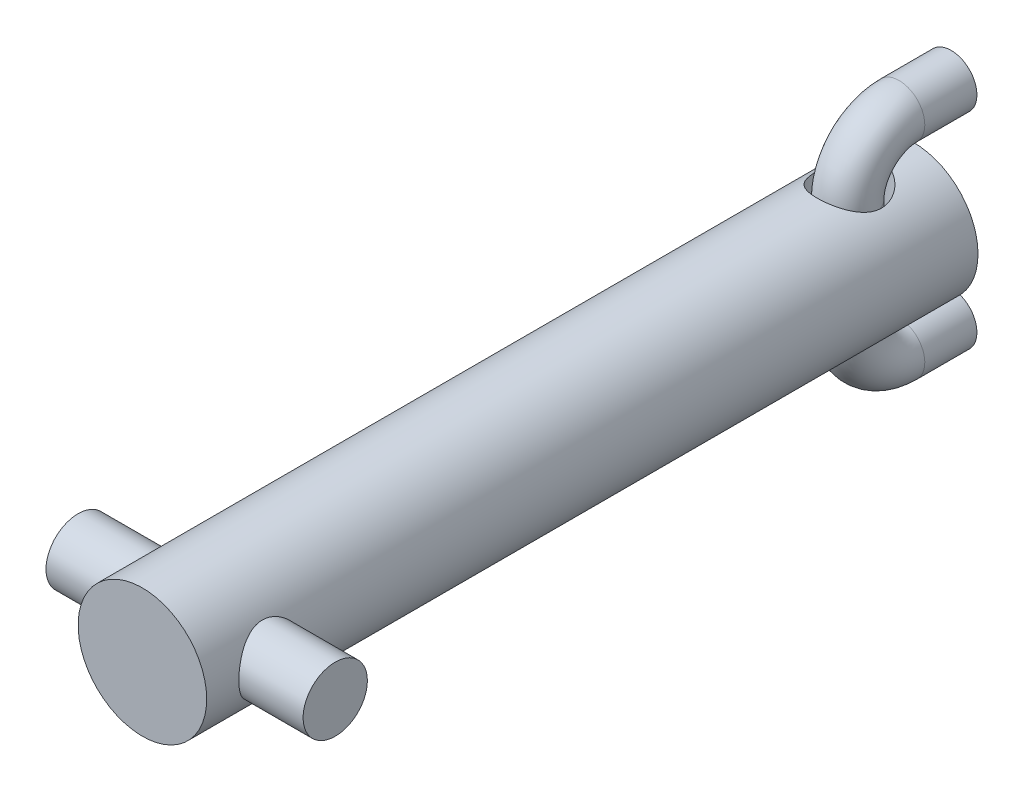
ISO-10303-21;
HEADER;
FILE_DESCRIPTION(('STEP AP214'),'2;1');
FILE_NAME('part.step','',(''),(''),'','','');
FILE_SCHEMA(('AUTOMOTIVE_DESIGN { 1 0 10303 214 1 1 1 1 }'));
ENDSEC;
DATA;
#1=APPLICATION_CONTEXT('core data for automotive mechanical design processes');
#2=APPLICATION_PROTOCOL_DEFINITION('international standard','automotive_design',2000,#1);
#3=PRODUCT_CONTEXT('',#1,'mechanical');
#4=PRODUCT('Part','Part','',(#3));
#5=PRODUCT_RELATED_PRODUCT_CATEGORY('part','',(#4));
#6=PRODUCT_DEFINITION_FORMATION('','',#4);
#7=PRODUCT_DEFINITION_CONTEXT('part definition',#1,'design');
#8=PRODUCT_DEFINITION('design','',#6,#7);
#9=PRODUCT_DEFINITION_SHAPE('','',#8);
#10=(LENGTH_UNIT() NAMED_UNIT(*) SI_UNIT(.MILLI.,.METRE.));
#11=(NAMED_UNIT(*) PLANE_ANGLE_UNIT() SI_UNIT($,.RADIAN.));
#12=(NAMED_UNIT(*) SI_UNIT($,.STERADIAN.) SOLID_ANGLE_UNIT());
#13=UNCERTAINTY_MEASURE_WITH_UNIT(LENGTH_MEASURE(1.E-05),#10,'distance_accuracy_value','');
#14=(GEOMETRIC_REPRESENTATION_CONTEXT(3) GLOBAL_UNCERTAINTY_ASSIGNED_CONTEXT((#13)) GLOBAL_UNIT_ASSIGNED_CONTEXT((#10,
#11,#12)) REPRESENTATION_CONTEXT('',''));
#15=CARTESIAN_POINT('',(0.,0.,0.));
#16=DIRECTION('',(0.,0.,1.));
#17=DIRECTION('',(1.,0.,0.));
#18=AXIS2_PLACEMENT_3D('',#15,#16,#17);
#19=CARTESIAN_POINT('',(0.,4.92250109258514,-1.85035109025268));
#20=DIRECTION('',(0.,0.,-1.));
#21=DIRECTION('',(1.,0.,0.));
#22=AXIS2_PLACEMENT_3D('',#19,#20,#21);
#23=PLANE('',#22);
#24=CARTESIAN_POINT('',(0.,4.92250109258514,-1.85035109025268));
#25=DIRECTION('',(0.,0.,-1.));
#26=DIRECTION('',(1.,0.,0.));
#27=AXIS2_PLACEMENT_3D('',#24,#25,#26);
#28=CIRCLE('',#27,1.27);
#29=CARTESIAN_POINT('',(1.27,4.92250109258514,-1.85035109025268));
#30=VERTEX_POINT('',#29);
#31=EDGE_CURVE('E80',#30,#30,#28,.T.);
#32=ORIENTED_EDGE('',*,*,#31,.T.);
#33=EDGE_LOOP('',(#32));
#34=FACE_BOUND('',#33,.T.);
#35=ADVANCED_FACE('F68',(#34),#23,.T.);
#36=CARTESIAN_POINT('',(0.,-5.23749890741486,-1.85035109025268));
#37=DIRECTION('',(0.,0.,1.));
#38=DIRECTION('',(1.,0.,0.));
#39=AXIS2_PLACEMENT_3D('',#36,#37,#38);
#40=PLANE('',#39);
#41=CARTESIAN_POINT('',(0.,-5.23749890741486,-1.85035109025268));
#42=DIRECTION('',(0.,0.,1.));
#43=DIRECTION('',(1.,0.,0.));
#44=AXIS2_PLACEMENT_3D('',#41,#42,#43);
#45=CIRCLE('',#44,1.27);
#46=CARTESIAN_POINT('',(1.27,-5.23749890741486,-1.85035109025268));
#47=VERTEX_POINT('',#46);
#48=EDGE_CURVE('E15',#47,#47,#45,.T.);
#49=ORIENTED_EDGE('',*,*,#48,.F.);
#50=EDGE_LOOP('',(#49));
#51=FACE_BOUND('',#50,.T.);
#52=ADVANCED_FACE('F86',(#51),#40,.F.);
#53=CARTESIAN_POINT('',(0.,4.92250109258514,-1.85035109025268));
#54=DIRECTION('',(0.,0.,1.));
#55=DIRECTION('',(1.,0.,0.));
#56=AXIS2_PLACEMENT_3D('',#53,#54,#55);
#57=CYLINDRICAL_SURFACE('',#56,1.27);
#58=CARTESIAN_POINT('',(0.,4.92250109258514,0.723036468645226));
#59=DIRECTION('',(0.,0.,-1.));
#60=DIRECTION('',(1.,0.,0.));
#61=AXIS2_PLACEMENT_3D('',#58,#59,#60);
#62=CIRCLE('',#61,1.27);
#63=CARTESIAN_POINT('',(0.,6.19250109258514,0.723036468645217));
#64=VERTEX_POINT('',#63);
#65=EDGE_CURVE('E120',#64,#64,#62,.T.);
#66=ORIENTED_EDGE('',*,*,#65,.T.);
#67=EDGE_LOOP('',(#66));
#68=FACE_BOUND('',#67,.T.);
#69=ORIENTED_EDGE('',*,*,#31,.F.);
#70=EDGE_LOOP('',(#69));
#71=FACE_BOUND('',#70,.T.);
#72=ADVANCED_FACE('F88',(#68,#71),#57,.T.);
#73=CARTESIAN_POINT('',(0.,2.38250109258514,0.723036468645244));
#74=DIRECTION('',(1.,0.,0.));
#75=DIRECTION('',(0.,0.,-1.));
#76=AXIS2_PLACEMENT_3D('',#73,#74,#75);
#77=TOROIDAL_SURFACE('',#76,2.54,1.27);
#78=CARTESIAN_POINT('',(0.,2.38250109258512,3.26303646864524));
#79=DIRECTION('',(0.,1.,0.));
#80=DIRECTION('',(1.,0.,0.));
#81=AXIS2_PLACEMENT_3D('',#78,#79,#80);
#82=CIRCLE('',#81,1.27);
#83=CARTESIAN_POINT('',(0.,2.38250109258512,4.53303646864524));
#84=VERTEX_POINT('',#83);
#85=EDGE_CURVE('E117',#84,#84,#82,.T.);
#86=CARTESIAN_POINT('',(0.,2.38250109258514,0.723036468645244));
#87=DIRECTION('',(1.,0.,0.));
#88=DIRECTION('',(0.,0.,-1.));
#89=AXIS2_PLACEMENT_3D('',#86,#87,#88);
#90=CIRCLE('',#89,3.81);
#91=EDGE_CURVE('',#64,#84,#90,.T.);
#92=ORIENTED_EDGE('',*,*,#65,.F.);
#93=ORIENTED_EDGE('',*,*,#85,.T.);
#94=ORIENTED_EDGE('',*,*,#91,.T.);
#95=ORIENTED_EDGE('',*,*,#91,.F.);
#96=EDGE_LOOP('',(#92,#94,#93,#95));
#97=FACE_BOUND('',#96,.T.);
#98=ADVANCED_FACE('F93',(#97),#77,.T.);
#99=CARTESIAN_POINT('',(0.,2.38250109258512,3.26303646864524));
#100=DIRECTION('',(0.,-1.,0.));
#101=DIRECTION('',(0.,0.,-1.));
#102=AXIS2_PLACEMENT_3D('',#99,#100,#101);
#103=CYLINDRICAL_SURFACE('',#102,1.27);
#104=CARTESIAN_POINT('',(0.,-2.69749890741484,3.26303646864524));
#105=DIRECTION('',(0.,1.,0.));
#106=DIRECTION('',(1.,0.,0.));
#107=AXIS2_PLACEMENT_3D('',#104,#105,#106);
#108=CIRCLE('',#107,1.27);
#109=CARTESIAN_POINT('',(0.,-2.69749890741483,4.53303646864524));
#110=VERTEX_POINT('',#109);
#111=EDGE_CURVE('E122',#110,#110,#108,.T.);
#112=ORIENTED_EDGE('',*,*,#111,.T.);
#113=EDGE_LOOP('',(#112));
#114=FACE_BOUND('',#113,.T.);
#115=ORIENTED_EDGE('',*,*,#85,.F.);
#116=EDGE_LOOP('',(#115));
#117=FACE_BOUND('',#116,.T.);
#118=ADVANCED_FACE('F103',(#114,#117),#103,.T.);
#119=CARTESIAN_POINT('',(0.,-2.69749890741486,0.723036468645245));
#120=DIRECTION('',(1.,0.,0.));
#121=DIRECTION('',(0.,0.,-1.));
#122=AXIS2_PLACEMENT_3D('',#119,#120,#121);
#123=TOROIDAL_SURFACE('',#122,2.54,1.27);
#124=CARTESIAN_POINT('',(0.,-5.23749890741487,0.723036468645263));
#125=DIRECTION('',(0.,0.,1.));
#126=DIRECTION('',(1.,0.,0.));
#127=AXIS2_PLACEMENT_3D('',#124,#125,#126);
#128=CIRCLE('',#127,1.27);
#129=CARTESIAN_POINT('',(0.,-6.50749890741486,0.723036468645273));
#130=VERTEX_POINT('',#129);
#131=EDGE_CURVE('E75',#130,#130,#128,.T.);
#132=CARTESIAN_POINT('',(0.,-2.69749890741486,0.723036468645245));
#133=DIRECTION('',(1.,0.,0.));
#134=DIRECTION('',(0.,0.,-1.));
#135=AXIS2_PLACEMENT_3D('',#132,#133,#134);
#136=CIRCLE('',#135,3.81);
#137=EDGE_CURVE('',#110,#130,#136,.T.);
#138=ORIENTED_EDGE('',*,*,#111,.F.);
#139=ORIENTED_EDGE('',*,*,#131,.T.);
#140=ORIENTED_EDGE('',*,*,#137,.T.);
#141=ORIENTED_EDGE('',*,*,#137,.F.);
#142=EDGE_LOOP('',(#138,#140,#139,#141));
#143=FACE_BOUND('',#142,.T.);
#144=ADVANCED_FACE('F99',(#143),#123,.T.);
#145=CARTESIAN_POINT('',(0.,-5.23749890741486,0.723036468645228));
#146=DIRECTION('',(0.,0.,-1.));
#147=DIRECTION('',(-1.,0.,0.));
#148=AXIS2_PLACEMENT_3D('',#145,#146,#147);
#149=CYLINDRICAL_SURFACE('',#148,1.27);
#150=ORIENTED_EDGE('',*,*,#48,.T.);
#151=EDGE_LOOP('',(#150));
#152=FACE_BOUND('',#151,.T.);
#153=ORIENTED_EDGE('',*,*,#131,.F.);
#154=EDGE_LOOP('',(#153));
#155=FACE_BOUND('',#154,.T.);
#156=ADVANCED_FACE('F83',(#152,#155),#149,.T.);
#157=CLOSED_SHELL('',(#35,#52,#72,#98,#118,#144,#156));
#158=MANIFOLD_SOLID_BREP('B2',#157);
#159=CARTESIAN_POINT('',(0.,0.,38.1));
#160=DIRECTION('',(0.,0.,-1.));
#161=DIRECTION('',(-1.,0.,0.));
#162=AXIS2_PLACEMENT_3D('',#159,#160,#161);
#163=CYLINDRICAL_SURFACE('',#162,3.175);
#164=CARTESIAN_POINT('',(0.,-3.175,4.7625));
#165=CARTESIAN_POINT('',(0.083457991185083,-3.17499545030502,4.76249475757146));
#166=CARTESIAN_POINT('',(0.16701547701988,-3.17167404493863,4.75588000892032));
#167=CARTESIAN_POINT('',(0.331660873489372,-3.15871472708987,4.72971355245781));
#168=CARTESIAN_POINT('',(0.412743787657886,-3.1490648192841,4.71013727611597));
#169=CARTESIAN_POINT('',(0.569807002497712,-3.12445843552858,4.6590048288211));
#170=CARTESIAN_POINT('',(0.645805799665894,-3.10952259694341,4.62749521500635));
#171=CARTESIAN_POINT('',(0.791325279180474,-3.07571420218771,4.55363163858309));
#172=CARTESIAN_POINT('',(0.860846471709218,-3.05684195643221,4.51127853100493));
#173=CARTESIAN_POINT('',(0.99616866069703,-3.01555559984673,4.41401636644211));
#174=CARTESIAN_POINT('',(1.06149014765635,-2.99299628614965,4.35850271420707));
#175=CARTESIAN_POINT('',(1.18233736872633,-2.94735202766705,4.23779715169533));
#176=CARTESIAN_POINT('',(1.23785563818199,-2.92426669731842,4.17259793531125));
#177=CARTESIAN_POINT('',(1.34183755071481,-2.87812085025789,4.02830768263163));
#178=CARTESIAN_POINT('',(1.38942022018822,-2.85520109315084,3.94853144387586));
#179=CARTESIAN_POINT('',(1.47029206018898,-2.81441491301059,3.78084185412188));
#180=CARTESIAN_POINT('',(1.50359144125905,-2.79654488326096,3.69293437065264));
#181=CARTESIAN_POINT('',(1.55278525197438,-2.76951863922521,3.5168441451427));
#182=CARTESIAN_POINT('',(1.5696022981152,-2.75990481139145,3.42899293234301));
#183=CARTESIAN_POINT('',(1.58817785187779,-2.74926250293288,3.25123359502508));
#184=CARTESIAN_POINT('',(1.58995124029226,-2.7482255383247,3.16132759136704));
#185=CARTESIAN_POINT('',(1.57906606838602,-2.75448601783382,2.99357093639935));
#186=CARTESIAN_POINT('',(1.5681079882647,-2.76080162313447,2.91556435043341));
#187=CARTESIAN_POINT('',(1.53501701037788,-2.77933513114987,2.76269146887029));
#188=CARTESIAN_POINT('',(1.51288055293752,-2.79155491395445,2.68782618182781));
#189=CARTESIAN_POINT('',(1.45765802636278,-2.82078868805226,2.54122375205201));
#190=CARTESIAN_POINT('',(1.42432891904664,-2.83790772054098,2.46960009192756));
#191=CARTESIAN_POINT('',(1.34785367917295,-2.87501654296728,2.33261806051336));
#192=CARTESIAN_POINT('',(1.30470313705229,-2.89500762088553,2.26726252223486));
#193=CARTESIAN_POINT('',(1.20342986217405,-2.93867138171466,2.13594751127013));
#194=CARTESIAN_POINT('',(1.14410245266123,-2.96248947500834,2.07096221319785));
#195=CARTESIAN_POINT('',(1.01529448125193,-3.00906851989396,1.95145752298694));
#196=CARTESIAN_POINT('',(0.945809094811679,-3.03182896234596,1.89694313264621));
#197=CARTESIAN_POINT('',(0.79456995300806,-3.07501904811705,1.79754901311531));
#198=CARTESIAN_POINT('',(0.712396326664062,-3.09529137357186,1.75323424999239));
#199=CARTESIAN_POINT('',(0.540490117088466,-3.12988136279972,1.67942096639422));
#200=CARTESIAN_POINT('',(0.450763602321127,-3.14420375322891,1.64991068128842));
#201=CARTESIAN_POINT('',(0.274266805511366,-3.16427379814529,1.60897029659978));
#202=CARTESIAN_POINT('',(0.187867179745469,-3.17063339553329,1.59624516325198));
#203=CARTESIAN_POINT('',(0.013937614919597,-3.17615908866327,1.585174739324));
#204=CARTESIAN_POINT('',(-0.0735917690434789,-3.17532859220093,1.58682263654734));
#205=CARTESIAN_POINT('',(-0.240082343027753,-3.16692267702328,1.60370311786476));
#206=CARTESIAN_POINT('',(-0.319181810279264,-3.15987502529967,1.61787289570887));
#207=CARTESIAN_POINT('',(-0.473720941529331,-3.14042696962309,1.65772793913351));
#208=CARTESIAN_POINT('',(-0.5491602010346,-3.12802597555879,1.68341447424492));
#209=CARTESIAN_POINT('',(-0.696735665913696,-3.09854999119071,1.74624756546244));
#210=CARTESIAN_POINT('',(-0.768715755246713,-3.08135149809289,1.78370079205961));
#211=CARTESIAN_POINT('',(-0.905607411697593,-3.043935592289,1.86865821283893));
#212=CARTESIAN_POINT('',(-0.970515949770339,-3.02371689462514,1.91616668867019));
#213=CARTESIAN_POINT('',(-1.09818120674663,-2.97986801371214,2.02526967521251));
#214=CARTESIAN_POINT('',(-1.16010067353771,-2.95609779689055,2.08778930365667));
#215=CARTESIAN_POINT('',(-1.27294690977618,-2.90929046679002,2.22238117765339));
#216=CARTESIAN_POINT('',(-1.3238660748176,-2.88625386997575,2.29445997617107));
#217=CARTESIAN_POINT('',(-1.41558631423544,-2.84243767627802,2.4505343009996));
#218=CARTESIAN_POINT('',(-1.45577797458289,-2.82182140722634,2.53493788492499));
#219=CARTESIAN_POINT('',(-1.52095648617134,-2.78723839766939,2.71067223227526));
#220=CARTESIAN_POINT('',(-1.54596292893889,-2.77326309427028,2.80199389826619));
#221=CARTESIAN_POINT('',(-1.57775542885366,-2.75528882878461,2.97959497882947));
#222=CARTESIAN_POINT('',(-1.58606013179365,-2.75046096250791,3.06551687732845));
#223=CARTESIAN_POINT('',(-1.58859403257222,-2.74900000493545,3.23762221912368));
#224=CARTESIAN_POINT('',(-1.5828293315144,-2.75236336156894,3.32380553287135));
#225=CARTESIAN_POINT('',(-1.55880772437938,-2.76602606006084,3.48533005868433));
#226=CARTESIAN_POINT('',(-1.54179319901957,-2.7756341249122,3.56092199635477));
#227=CARTESIAN_POINT('',(-1.49729088118125,-2.79988988197899,3.70809538958618));
#228=CARTESIAN_POINT('',(-1.46979971971638,-2.81453919516849,3.7796755465711));
#229=CARTESIAN_POINT('',(-1.40305749566465,-2.848427919537,3.92211695094113));
#230=CARTESIAN_POINT('',(-1.36314043128243,-2.86790959303524,3.99260679415358));
#231=CARTESIAN_POINT('',(-1.27341466747436,-2.90886088970341,4.12634832618775));
#232=CARTESIAN_POINT('',(-1.22360082184598,-2.93033154400532,4.18959622220226));
#233=CARTESIAN_POINT('',(-1.10839778107493,-2.97596438013471,4.31505039698805));
#234=CARTESIAN_POINT('',(-1.04185152150815,-3.00013660999272,4.37619632498109));
#235=CARTESIAN_POINT('',(-0.898770754895201,-3.0460593171264,4.48669248620349));
#236=CARTESIAN_POINT('',(-0.822230898247,-3.06780848569085,4.53603636140848));
#237=CARTESIAN_POINT('',(-0.660291409892926,-3.10670590186878,4.62158772580541));
#238=CARTESIAN_POINT('',(-0.574832962245559,-3.12382053184118,4.65769986866289));
#239=CARTESIAN_POINT('',(-0.398053085556712,-3.15120879312142,4.71457046631489));
#240=CARTESIAN_POINT('',(-0.306749131847695,-3.1615018583887,4.73537255680407));
#241=CARTESIAN_POINT('',(-0.178755590054295,-3.17016545787646,4.75281214009861));
#242=CARTESIAN_POINT('',(-0.143131983613483,-3.17197367477648,4.75643994237531));
#243=CARTESIAN_POINT('',(-0.0716783742405821,-3.17439193950695,4.76128503150361));
#244=CARTESIAN_POINT('',(-0.0358483656390222,-3.17500195426617,4.76250225182145));
#245=CARTESIAN_POINT('',(0.,-3.175,4.7625));
#246=B_SPLINE_CURVE_WITH_KNOTS('',3,(#164,#165,#166,#167,#168,#169,#170,#171,#172,#173,#174,
#175,#176,#177,#178,#179,#180,#181,#182,#183,#184,#185,#186,#187,#188,#189,#190,#191,#192,#193,
#194,#195,#196,#197,#198,#199,#200,#201,#202,#203,#204,#205,#206,#207,#208,#209,#210,#211,#212,
#213,#214,#215,#216,#217,#218,#219,#220,#221,#222,#223,#224,#225,#226,#227,#228,#229,#230,#231,
#232,#233,#234,#235,#236,#237,#238,#239,#240,#241,#242,#243,#244,#245),.UNSPECIFIED.,.T.,.F.,(4,
2,2,2,2,2,2,2,2,2,2,2,2,2,2,2,2,2,2,2,2,2,2,2,2,2,2,2,2,2,2,2,2,2,2,2,2,2,2,2,4),(0.,
0.250228508654714,0.50093268766335,0.750668671844022,1.00038496992324,1.26520854196496,
1.53023290227578,1.8158099070882,2.10118242288521,2.36947094272614,2.6374940475982,
2.87346568449797,3.10951251232015,3.35105756267474,3.59271127500602,3.86500594367532,
4.13743036175414,4.42250547765424,4.70735369348244,4.96860973623261,5.22974196161968,
5.47063464078469,5.71155388089104,5.95936158944289,6.20727503062989,6.47953381898015,
6.75198021926998,7.0376205793174,7.32289162713403,7.58077775661086,7.83855207535177,
8.07176964270058,8.30506226951507,8.55402875138706,8.80312503315514,9.0824882287701,
9.36200158617728,9.64349121690848,9.92417542436075,10.0316550721259,10.1391376863632),.UNSPECIFIED.);
#247=CARTESIAN_POINT('',(0.,-3.175,4.7625));
#248=VERTEX_POINT('',#247);
#249=EDGE_CURVE('E195',#248,#248,#246,.T.);
#250=ORIENTED_EDGE('',*,*,#249,.T.);
#251=EDGE_LOOP('',(#250));
#252=FACE_BOUND('',#251,.T.);
#253=CARTESIAN_POINT('',(0.,3.175,4.7625));
#254=CARTESIAN_POINT('',(-0.0834579911850828,3.17499545030503,4.76249475757146));
#255=CARTESIAN_POINT('',(-0.16701547701988,3.17167404493863,4.75588000892032));
#256=CARTESIAN_POINT('',(-0.331660873489372,3.15871472708987,4.72971355245781));
#257=CARTESIAN_POINT('',(-0.412743787657886,3.1490648192841,4.71013727611597));
#258=CARTESIAN_POINT('',(-0.569807002497712,3.12445843552858,4.6590048288211));
#259=CARTESIAN_POINT('',(-0.645805799665894,3.10952259694341,4.62749521500635));
#260=CARTESIAN_POINT('',(-0.791325279180474,3.07571420218771,4.55363163858309));
#261=CARTESIAN_POINT('',(-0.860846471709217,3.05684195643221,4.51127853100493));
#262=CARTESIAN_POINT('',(-0.99616866069703,3.01555559984673,4.41401636644211));
#263=CARTESIAN_POINT('',(-1.06149014765635,2.99299628614965,4.35850271420707));
#264=CARTESIAN_POINT('',(-1.18233736872633,2.94735202766705,4.23779715169533));
#265=CARTESIAN_POINT('',(-1.23785563818199,2.92426669731843,4.17259793531125));
#266=CARTESIAN_POINT('',(-1.34183755071481,2.87812085025789,4.02830768263163));
#267=CARTESIAN_POINT('',(-1.38942022018822,2.85520109315084,3.94853144387586));
#268=CARTESIAN_POINT('',(-1.47029206018898,2.81441491301059,3.78084185412188));
#269=CARTESIAN_POINT('',(-1.50359144125905,2.79654488326096,3.69293437065264));
#270=CARTESIAN_POINT('',(-1.55278525197438,2.76951863922521,3.5168441451427));
#271=CARTESIAN_POINT('',(-1.5696022981152,2.75990481139145,3.42899293234301));
#272=CARTESIAN_POINT('',(-1.58817785187779,2.74926250293288,3.25123359502508));
#273=CARTESIAN_POINT('',(-1.58995124029226,2.7482255383247,3.16132759136704));
#274=CARTESIAN_POINT('',(-1.57906606838602,2.75448601783382,2.99357093639935));
#275=CARTESIAN_POINT('',(-1.5681079882647,2.76080162313447,2.91556435043341));
#276=CARTESIAN_POINT('',(-1.53501701037788,2.77933513114987,2.76269146887029));
#277=CARTESIAN_POINT('',(-1.51288055293752,2.79155491395445,2.68782618182781));
#278=CARTESIAN_POINT('',(-1.45765802636278,2.82078868805226,2.54122375205201));
#279=CARTESIAN_POINT('',(-1.42432891904664,2.83790772054098,2.46960009192756));
#280=CARTESIAN_POINT('',(-1.34785367917295,2.87501654296728,2.33261806051336));
#281=CARTESIAN_POINT('',(-1.30470313705229,2.89500762088553,2.26726252223486));
#282=CARTESIAN_POINT('',(-1.20342986217405,2.93867138171466,2.13594751127013));
#283=CARTESIAN_POINT('',(-1.14410245266124,2.96248947500834,2.07096221319785));
#284=CARTESIAN_POINT('',(-1.01529448125193,3.00906851989396,1.95145752298694));
#285=CARTESIAN_POINT('',(-0.945809094811679,3.03182896234596,1.89694313264621));
#286=CARTESIAN_POINT('',(-0.794569953008061,3.07501904811705,1.79754901311531));
#287=CARTESIAN_POINT('',(-0.712396326664063,3.09529137357186,1.75323424999239));
#288=CARTESIAN_POINT('',(-0.540490117088467,3.12988136279972,1.67942096639422));
#289=CARTESIAN_POINT('',(-0.450763602321127,3.14420375322891,1.64991068128842));
#290=CARTESIAN_POINT('',(-0.274266805511367,3.16427379814529,1.60897029659978));
#291=CARTESIAN_POINT('',(-0.18786717974547,3.17063339553329,1.59624516325198));
#292=CARTESIAN_POINT('',(-0.0139376149195974,3.17615908866327,1.585174739324));
#293=CARTESIAN_POINT('',(0.0735917690434786,3.17532859220093,1.58682263654734));
#294=CARTESIAN_POINT('',(0.240082343027753,3.16692267702328,1.60370311786476));
#295=CARTESIAN_POINT('',(0.319181810279263,3.15987502529967,1.61787289570887));
#296=CARTESIAN_POINT('',(0.47372094152933,3.14042696962309,1.65772793913351));
#297=CARTESIAN_POINT('',(0.5491602010346,3.12802597555879,1.68341447424492));
#298=CARTESIAN_POINT('',(0.696735665913696,3.09854999119071,1.74624756546244));
#299=CARTESIAN_POINT('',(0.768715755246713,3.08135149809289,1.78370079205961));
#300=CARTESIAN_POINT('',(0.905607411697593,3.043935592289,1.86865821283893));
#301=CARTESIAN_POINT('',(0.970515949770339,3.02371689462514,1.91616668867019));
#302=CARTESIAN_POINT('',(1.09818120674663,2.97986801371214,2.02526967521251));
#303=CARTESIAN_POINT('',(1.1601006735377,2.95609779689055,2.08778930365667));
#304=CARTESIAN_POINT('',(1.27294690977618,2.90929046679002,2.22238117765339));
#305=CARTESIAN_POINT('',(1.3238660748176,2.88625386997575,2.29445997617107));
#306=CARTESIAN_POINT('',(1.41558631423544,2.84243767627802,2.4505343009996));
#307=CARTESIAN_POINT('',(1.45577797458289,2.82182140722634,2.53493788492499));
#308=CARTESIAN_POINT('',(1.52095648617134,2.78723839766939,2.71067223227526));
#309=CARTESIAN_POINT('',(1.54596292893889,2.77326309427028,2.80199389826619));
#310=CARTESIAN_POINT('',(1.57775542885366,2.75528882878461,2.97959497882947));
#311=CARTESIAN_POINT('',(1.58606013179365,2.75046096250791,3.06551687732845));
#312=CARTESIAN_POINT('',(1.58859403257222,2.74900000493545,3.23762221912368));
#313=CARTESIAN_POINT('',(1.5828293315144,2.75236336156894,3.32380553287135));
#314=CARTESIAN_POINT('',(1.55880772437938,2.76602606006084,3.48533005868433));
#315=CARTESIAN_POINT('',(1.54179319901957,2.7756341249122,3.56092199635477));
#316=CARTESIAN_POINT('',(1.49729088118125,2.79988988197899,3.70809538958618));
#317=CARTESIAN_POINT('',(1.46979971971638,2.81453919516849,3.7796755465711));
#318=CARTESIAN_POINT('',(1.40305749566465,2.848427919537,3.92211695094113));
#319=CARTESIAN_POINT('',(1.36314043128243,2.86790959303524,3.99260679415358));
#320=CARTESIAN_POINT('',(1.27341466747436,2.90886088970341,4.12634832618775));
#321=CARTESIAN_POINT('',(1.22360082184598,2.93033154400532,4.18959622220226));
#322=CARTESIAN_POINT('',(1.10839778107493,2.97596438013471,4.31505039698805));
#323=CARTESIAN_POINT('',(1.04185152150815,3.00013660999272,4.37619632498109));
#324=CARTESIAN_POINT('',(0.8987707548952,3.0460593171264,4.48669248620349));
#325=CARTESIAN_POINT('',(0.822230898247,3.06780848569085,4.53603636140848));
#326=CARTESIAN_POINT('',(0.660291409892925,3.10670590186878,4.62158772580541));
#327=CARTESIAN_POINT('',(0.574832962245559,3.12382053184118,4.65769986866289));
#328=CARTESIAN_POINT('',(0.398053085556711,3.15120879312142,4.71457046631489));
#329=CARTESIAN_POINT('',(0.306749131847695,3.1615018583887,4.73537255680407));
#330=CARTESIAN_POINT('',(0.178755590054295,3.17016545787646,4.75281214009861));
#331=CARTESIAN_POINT('',(0.143131983613483,3.17197367477648,4.75643994237531));
#332=CARTESIAN_POINT('',(0.0716783742405818,3.17439193950695,4.76128503150361));
#333=CARTESIAN_POINT('',(0.0358483656390221,3.17500195426617,4.76250225182145));
#334=CARTESIAN_POINT('',(0.,3.175,4.7625));
#335=B_SPLINE_CURVE_WITH_KNOTS('',3,(#253,#254,#255,#256,#257,#258,#259,#260,#261,#262,#263,
#264,#265,#266,#267,#268,#269,#270,#271,#272,#273,#274,#275,#276,#277,#278,#279,#280,#281,#282,
#283,#284,#285,#286,#287,#288,#289,#290,#291,#292,#293,#294,#295,#296,#297,#298,#299,#300,#301,
#302,#303,#304,#305,#306,#307,#308,#309,#310,#311,#312,#313,#314,#315,#316,#317,#318,#319,#320,
#321,#322,#323,#324,#325,#326,#327,#328,#329,#330,#331,#332,#333,#334),.UNSPECIFIED.,.T.,.F.,(4,
2,2,2,2,2,2,2,2,2,2,2,2,2,2,2,2,2,2,2,2,2,2,2,2,2,2,2,2,2,2,2,2,2,2,2,2,2,2,2,4),(0.,
0.250228508654714,0.50093268766335,0.750668671844022,1.00038496992324,1.26520854196496,
1.53023290227578,1.8158099070882,2.10118242288521,2.36947094272614,2.6374940475982,
2.87346568449796,3.10951251232015,3.35105756267474,3.59271127500602,3.86500594367532,
4.13743036175414,4.42250547765424,4.70735369348243,4.96860973623261,5.22974196161968,
5.47063464078468,5.71155388089104,5.95936158944289,6.20727503062988,6.47953381898015,
6.75198021926998,7.03762057931739,7.32289162713403,7.58077775661086,7.83855207535176,
8.07176964270058,8.30506226951507,8.55402875138705,8.80312503315514,9.0824882287701,
9.36200158617727,9.64349121690848,9.92417542436075,10.0316550721259,10.1391376863632),.UNSPECIFIED.);
#336=CARTESIAN_POINT('',(0.,3.175,4.7625));
#337=VERTEX_POINT('',#336);
#338=EDGE_CURVE('E219',#337,#337,#335,.T.);
#339=ORIENTED_EDGE('',*,*,#338,.T.);
#340=EDGE_LOOP('',(#339));
#341=FACE_BOUND('',#340,.T.);
#342=CARTESIAN_POINT('',(0.,0.,38.1));
#343=DIRECTION('',(0.,0.,1.));
#344=DIRECTION('',(1.,0.,0.));
#345=AXIS2_PLACEMENT_3D('',#342,#343,#344);
#346=CIRCLE('',#345,3.175);
#347=CARTESIAN_POINT('',(3.175,0.,38.1));
#348=VERTEX_POINT('',#347);
#349=EDGE_CURVE('E185',#348,#348,#346,.T.);
#350=ORIENTED_EDGE('',*,*,#349,.F.);
#351=EDGE_LOOP('',(#350));
#352=FACE_BOUND('',#351,.T.);
#353=CARTESIAN_POINT('',(0.,0.,0.));
#354=DIRECTION('',(0.,0.,1.));
#355=DIRECTION('',(1.,0.,0.));
#356=AXIS2_PLACEMENT_3D('',#353,#354,#355);
#357=CIRCLE('',#356,3.175);
#358=CARTESIAN_POINT('',(3.175,0.,0.));
#359=VERTEX_POINT('',#358);
#360=EDGE_CURVE('E189',#359,#359,#357,.T.);
#361=ORIENTED_EDGE('',*,*,#360,.T.);
#362=EDGE_LOOP('',(#361));
#363=FACE_BOUND('',#362,.T.);
#364=CARTESIAN_POINT('',(3.175,0.,36.5125));
#365=CARTESIAN_POINT('',(3.17499545030503,-0.0834579911850831,36.5124947575715));
#366=CARTESIAN_POINT('',(3.17167404493863,-0.16701547701988,36.5058800089203));
#367=CARTESIAN_POINT('',(3.15871472708987,-0.331660873489373,36.4797135524578));
#368=CARTESIAN_POINT('',(3.1490648192841,-0.412743787657887,36.460137276116));
#369=CARTESIAN_POINT('',(3.12445843552858,-0.569807002497713,36.4090048288211));
#370=CARTESIAN_POINT('',(3.10952259694341,-0.645805799665895,36.3774952150064));
#371=CARTESIAN_POINT('',(3.07571420218771,-0.791325279180475,36.3036316385831));
#372=CARTESIAN_POINT('',(3.05684195643221,-0.860846471709218,36.2612785310049));
#373=CARTESIAN_POINT('',(3.01555559984673,-0.996168660697029,36.1640163664421));
#374=CARTESIAN_POINT('',(2.99299628614965,-1.06149014765635,36.1085027142071));
#375=CARTESIAN_POINT('',(2.94735202766705,-1.18233736872633,35.9877971516953));
#376=CARTESIAN_POINT('',(2.92426669731843,-1.23785563818199,35.9225979353113));
#377=CARTESIAN_POINT('',(2.87812085025789,-1.34183755071481,35.7783076826316));
#378=CARTESIAN_POINT('',(2.85520109315084,-1.38942022018822,35.6985314438759));
#379=CARTESIAN_POINT('',(2.81441491301059,-1.47029206018898,35.5308418541219));
#380=CARTESIAN_POINT('',(2.79654488326096,-1.50359144125906,35.4429343706526));
#381=CARTESIAN_POINT('',(2.76951863922521,-1.55278525197438,35.2668441451427));
#382=CARTESIAN_POINT('',(2.75990481139145,-1.5696022981152,35.178992932343));
#383=CARTESIAN_POINT('',(2.74926250293288,-1.58817785187779,35.0012335950251));
#384=CARTESIAN_POINT('',(2.7482255383247,-1.58995124029225,34.9113275913671));
#385=CARTESIAN_POINT('',(2.75448601783382,-1.57906606838602,34.7435709363994));
#386=CARTESIAN_POINT('',(2.76080162313446,-1.5681079882647,34.6655643504334));
#387=CARTESIAN_POINT('',(2.77933513114987,-1.53501701037788,34.5126914688703));
#388=CARTESIAN_POINT('',(2.79155491395445,-1.51288055293752,34.4378261818278));
#389=CARTESIAN_POINT('',(2.82078868805226,-1.45765802636278,34.291223752052));
#390=CARTESIAN_POINT('',(2.83790772054098,-1.42432891904664,34.2196000919276));
#391=CARTESIAN_POINT('',(2.87501654296728,-1.34785367917296,34.0826180605134));
#392=CARTESIAN_POINT('',(2.89500762088552,-1.30470313705229,34.0172625222349));
#393=CARTESIAN_POINT('',(2.93867138171466,-1.20342986217405,33.8859475112701));
#394=CARTESIAN_POINT('',(2.96248947500834,-1.14410245266123,33.8209622131979));
#395=CARTESIAN_POINT('',(3.00906851989397,-1.01529448125193,33.701457522987));
#396=CARTESIAN_POINT('',(3.03182896234596,-0.945809094811676,33.6469431326462));
#397=CARTESIAN_POINT('',(3.07501904811705,-0.794569953008058,33.5475490131153));
#398=CARTESIAN_POINT('',(3.09529137357186,-0.71239632666406,33.5032342499924));
#399=CARTESIAN_POINT('',(3.12988136279972,-0.540490117088465,33.4294209663942));
#400=CARTESIAN_POINT('',(3.14420375322891,-0.450763602321128,33.3999106812884));
#401=CARTESIAN_POINT('',(3.16427379814529,-0.274266805511368,33.3589702965998));
#402=CARTESIAN_POINT('',(3.17063339553329,-0.18786717974547,33.346245163252));
#403=CARTESIAN_POINT('',(3.17615908866327,-0.0139376149195973,33.335174739324));
#404=CARTESIAN_POINT('',(3.17532859220093,0.0735917690434788,33.3368226365474));
#405=CARTESIAN_POINT('',(3.16692267702328,0.240082343027752,33.3537031178648));
#406=CARTESIAN_POINT('',(3.15987502529967,0.319181810279261,33.3678728957089));
#407=CARTESIAN_POINT('',(3.14042696962309,0.473720941529329,33.4077279391335));
#408=CARTESIAN_POINT('',(3.12802597555879,0.549160201034598,33.4334144742449));
#409=CARTESIAN_POINT('',(3.09854999119071,0.696735665913695,33.4962475654625));
#410=CARTESIAN_POINT('',(3.08135149809289,0.768715755246712,33.5337007920596));
#411=CARTESIAN_POINT('',(3.04393559228901,0.905607411697592,33.6186582128389));
#412=CARTESIAN_POINT('',(3.02371689462515,0.970515949770337,33.6661666886702));
#413=CARTESIAN_POINT('',(2.97986801371214,1.09818120674663,33.7752696752125));
#414=CARTESIAN_POINT('',(2.95609779689055,1.1601006735377,33.8377893036567));
#415=CARTESIAN_POINT('',(2.90929046679002,1.27294690977618,33.9723811776534));
#416=CARTESIAN_POINT('',(2.88625386997575,1.3238660748176,34.0444599761711));
#417=CARTESIAN_POINT('',(2.84243767627802,1.41558631423544,34.2005343009996));
#418=CARTESIAN_POINT('',(2.82182140722634,1.45577797458289,34.284937884925));
#419=CARTESIAN_POINT('',(2.78723839766939,1.52095648617134,34.4606722322753));
#420=CARTESIAN_POINT('',(2.77326309427028,1.54596292893889,34.5519938982662));
#421=CARTESIAN_POINT('',(2.75528882878461,1.57775542885366,34.7295949788295));
#422=CARTESIAN_POINT('',(2.75046096250791,1.58606013179365,34.8155168773284));
#423=CARTESIAN_POINT('',(2.74900000493545,1.58859403257222,34.9876222191237));
#424=CARTESIAN_POINT('',(2.75236336156894,1.5828293315144,35.0738055328714));
#425=CARTESIAN_POINT('',(2.76602606006084,1.55880772437938,35.2353300586843));
#426=CARTESIAN_POINT('',(2.7756341249122,1.54179319901956,35.3109219963548));
#427=CARTESIAN_POINT('',(2.79988988197899,1.49729088118125,35.4580953895862));
#428=CARTESIAN_POINT('',(2.81453919516849,1.46979971971637,35.5296755465711));
#429=CARTESIAN_POINT('',(2.848427919537,1.40305749566465,35.6721169509411));
#430=CARTESIAN_POINT('',(2.86790959303524,1.36314043128242,35.7426067941536));
#431=CARTESIAN_POINT('',(2.90886088970341,1.27341466747436,35.8763483261878));
#432=CARTESIAN_POINT('',(2.93033154400532,1.22360082184598,35.9395962222023));
#433=CARTESIAN_POINT('',(2.97596438013471,1.10839778107493,36.0650503969881));
#434=CARTESIAN_POINT('',(3.00013660999272,1.04185152150815,36.1261963249811));
#435=CARTESIAN_POINT('',(3.0460593171264,0.898770754895202,36.2366924862035));
#436=CARTESIAN_POINT('',(3.06780848569085,0.822230898247002,36.2860363614085));
#437=CARTESIAN_POINT('',(3.10670590186878,0.660291409892929,36.3715877258054));
#438=CARTESIAN_POINT('',(3.12382053184118,0.574832962245563,36.4076998686629));
#439=CARTESIAN_POINT('',(3.15120879312141,0.398053085556715,36.4645704663149));
#440=CARTESIAN_POINT('',(3.1615018583887,0.306749131847698,36.4853725568041));
#441=CARTESIAN_POINT('',(3.17016545787646,0.178755590054296,36.5028121400986));
#442=CARTESIAN_POINT('',(3.17197367477648,0.143131983613484,36.5064399423753));
#443=CARTESIAN_POINT('',(3.17439193950695,0.071678374240583,36.5112850315036));
#444=CARTESIAN_POINT('',(3.17500195426617,0.0358483656390227,36.5125022518215));
#445=CARTESIAN_POINT('',(3.175,0.,36.5125));
#446=B_SPLINE_CURVE_WITH_KNOTS('',3,(#364,#365,#366,#367,#368,#369,#370,#371,#372,#373,#374,
#375,#376,#377,#378,#379,#380,#381,#382,#383,#384,#385,#386,#387,#388,#389,#390,#391,#392,#393,
#394,#395,#396,#397,#398,#399,#400,#401,#402,#403,#404,#405,#406,#407,#408,#409,#410,#411,#412,
#413,#414,#415,#416,#417,#418,#419,#420,#421,#422,#423,#424,#425,#426,#427,#428,#429,#430,#431,
#432,#433,#434,#435,#436,#437,#438,#439,#440,#441,#442,#443,#444,#445),.UNSPECIFIED.,.T.,.F.,(4,
2,2,2,2,2,2,2,2,2,2,2,2,2,2,2,2,2,2,2,2,2,2,2,2,2,2,2,2,2,2,2,2,2,2,2,2,2,2,2,4),(0.,
0.250228508654715,0.50093268766335,0.750668671844024,1.00038496992324,1.26520854196496,
1.53023290227578,1.8158099070882,2.10118242288522,2.36947094272614,2.63749404759819,
2.87346568449795,3.10951251232014,3.35105756267472,3.59271127500601,3.86500594367532,
4.13743036175415,4.42250547765424,4.70735369348243,4.96860973623261,5.22974196161968,
5.47063464078468,5.71155388089103,5.95936158944289,6.20727503062988,6.47953381898014,
6.75198021926998,7.03762057931739,7.32289162713402,7.58077775661085,7.83855207535176,
8.07176964270058,8.30506226951506,8.55402875138705,8.80312503315513,9.08248822877009,
9.36200158617726,9.64349121690847,9.92417542436073,10.0316550721259,10.1391376863632),.UNSPECIFIED.);
#447=CARTESIAN_POINT('',(3.175,0.,36.5125));
#448=VERTEX_POINT('',#447);
#449=EDGE_CURVE('E181',#448,#448,#446,.T.);
#450=ORIENTED_EDGE('',*,*,#449,.F.);
#451=EDGE_LOOP('',(#450));
#452=FACE_BOUND('',#451,.T.);
#453=CARTESIAN_POINT('',(-3.175,0.,36.5125));
#454=CARTESIAN_POINT('',(-3.17499545030503,0.0834579911850831,36.5124947575715));
#455=CARTESIAN_POINT('',(-3.17167404493863,0.16701547701988,36.5058800089203));
#456=CARTESIAN_POINT('',(-3.15871472708987,0.331660873489373,36.4797135524578));
#457=CARTESIAN_POINT('',(-3.1490648192841,0.412743787657887,36.460137276116));
#458=CARTESIAN_POINT('',(-3.12445843552858,0.569807002497713,36.4090048288211));
#459=CARTESIAN_POINT('',(-3.10952259694341,0.645805799665895,36.3774952150064));
#460=CARTESIAN_POINT('',(-3.07571420218771,0.791325279180475,36.3036316385831));
#461=CARTESIAN_POINT('',(-3.05684195643221,0.860846471709218,36.2612785310049));
#462=CARTESIAN_POINT('',(-3.01555559984673,0.996168660697029,36.1640163664421));
#463=CARTESIAN_POINT('',(-2.99299628614965,1.06149014765635,36.1085027142071));
#464=CARTESIAN_POINT('',(-2.94735202766705,1.18233736872633,35.9877971516953));
#465=CARTESIAN_POINT('',(-2.92426669731843,1.23785563818199,35.9225979353113));
#466=CARTESIAN_POINT('',(-2.87812085025789,1.34183755071481,35.7783076826316));
#467=CARTESIAN_POINT('',(-2.85520109315084,1.38942022018822,35.6985314438759));
#468=CARTESIAN_POINT('',(-2.81441491301059,1.47029206018898,35.5308418541219));
#469=CARTESIAN_POINT('',(-2.79654488326096,1.50359144125906,35.4429343706526));
#470=CARTESIAN_POINT('',(-2.76951863922521,1.55278525197438,35.2668441451427));
#471=CARTESIAN_POINT('',(-2.75990481139145,1.5696022981152,35.178992932343));
#472=CARTESIAN_POINT('',(-2.74926250293288,1.58817785187779,35.0012335950251));
#473=CARTESIAN_POINT('',(-2.7482255383247,1.58995124029225,34.9113275913671));
#474=CARTESIAN_POINT('',(-2.75448601783382,1.57906606838602,34.7435709363994));
#475=CARTESIAN_POINT('',(-2.76080162313446,1.5681079882647,34.6655643504334));
#476=CARTESIAN_POINT('',(-2.77933513114987,1.53501701037788,34.5126914688703));
#477=CARTESIAN_POINT('',(-2.79155491395445,1.51288055293752,34.4378261818278));
#478=CARTESIAN_POINT('',(-2.82078868805226,1.45765802636278,34.291223752052));
#479=CARTESIAN_POINT('',(-2.83790772054098,1.42432891904664,34.2196000919276));
#480=CARTESIAN_POINT('',(-2.87501654296728,1.34785367917296,34.0826180605134));
#481=CARTESIAN_POINT('',(-2.89500762088552,1.30470313705229,34.0172625222349));
#482=CARTESIAN_POINT('',(-2.93867138171466,1.20342986217405,33.8859475112701));
#483=CARTESIAN_POINT('',(-2.96248947500834,1.14410245266123,33.8209622131979));
#484=CARTESIAN_POINT('',(-3.00906851989397,1.01529448125193,33.701457522987));
#485=CARTESIAN_POINT('',(-3.03182896234596,0.945809094811676,33.6469431326462));
#486=CARTESIAN_POINT('',(-3.07501904811705,0.794569953008058,33.5475490131153));
#487=CARTESIAN_POINT('',(-3.09529137357186,0.71239632666406,33.5032342499924));
#488=CARTESIAN_POINT('',(-3.12988136279972,0.540490117088465,33.4294209663942));
#489=CARTESIAN_POINT('',(-3.14420375322891,0.450763602321128,33.3999106812884));
#490=CARTESIAN_POINT('',(-3.16427379814529,0.274266805511368,33.3589702965998));
#491=CARTESIAN_POINT('',(-3.17063339553329,0.18786717974547,33.346245163252));
#492=CARTESIAN_POINT('',(-3.17615908866327,0.0139376149195973,33.335174739324));
#493=CARTESIAN_POINT('',(-3.17532859220093,-0.0735917690434788,33.3368226365474));
#494=CARTESIAN_POINT('',(-3.16692267702328,-0.240082343027752,33.3537031178648));
#495=CARTESIAN_POINT('',(-3.15987502529967,-0.319181810279261,33.3678728957089));
#496=CARTESIAN_POINT('',(-3.14042696962309,-0.473720941529329,33.4077279391335));
#497=CARTESIAN_POINT('',(-3.12802597555879,-0.549160201034598,33.4334144742449));
#498=CARTESIAN_POINT('',(-3.09854999119071,-0.696735665913695,33.4962475654625));
#499=CARTESIAN_POINT('',(-3.08135149809289,-0.768715755246712,33.5337007920596));
#500=CARTESIAN_POINT('',(-3.04393559228901,-0.905607411697592,33.6186582128389));
#501=CARTESIAN_POINT('',(-3.02371689462515,-0.970515949770337,33.6661666886702));
#502=CARTESIAN_POINT('',(-2.97986801371214,-1.09818120674663,33.7752696752125));
#503=CARTESIAN_POINT('',(-2.95609779689055,-1.1601006735377,33.8377893036567));
#504=CARTESIAN_POINT('',(-2.90929046679002,-1.27294690977618,33.9723811776534));
#505=CARTESIAN_POINT('',(-2.88625386997575,-1.3238660748176,34.0444599761711));
#506=CARTESIAN_POINT('',(-2.84243767627802,-1.41558631423544,34.2005343009996));
#507=CARTESIAN_POINT('',(-2.82182140722634,-1.45577797458289,34.284937884925));
#508=CARTESIAN_POINT('',(-2.78723839766939,-1.52095648617134,34.4606722322753));
#509=CARTESIAN_POINT('',(-2.77326309427028,-1.54596292893889,34.5519938982662));
#510=CARTESIAN_POINT('',(-2.75528882878461,-1.57775542885366,34.7295949788295));
#511=CARTESIAN_POINT('',(-2.75046096250791,-1.58606013179365,34.8155168773284));
#512=CARTESIAN_POINT('',(-2.74900000493545,-1.58859403257222,34.9876222191237));
#513=CARTESIAN_POINT('',(-2.75236336156894,-1.5828293315144,35.0738055328714));
#514=CARTESIAN_POINT('',(-2.76602606006084,-1.55880772437938,35.2353300586843));
#515=CARTESIAN_POINT('',(-2.7756341249122,-1.54179319901956,35.3109219963548));
#516=CARTESIAN_POINT('',(-2.79988988197899,-1.49729088118125,35.4580953895862));
#517=CARTESIAN_POINT('',(-2.81453919516849,-1.46979971971637,35.5296755465711));
#518=CARTESIAN_POINT('',(-2.848427919537,-1.40305749566465,35.6721169509411));
#519=CARTESIAN_POINT('',(-2.86790959303524,-1.36314043128242,35.7426067941536));
#520=CARTESIAN_POINT('',(-2.90886088970341,-1.27341466747436,35.8763483261878));
#521=CARTESIAN_POINT('',(-2.93033154400532,-1.22360082184598,35.9395962222023));
#522=CARTESIAN_POINT('',(-2.97596438013471,-1.10839778107493,36.0650503969881));
#523=CARTESIAN_POINT('',(-3.00013660999272,-1.04185152150815,36.1261963249811));
#524=CARTESIAN_POINT('',(-3.0460593171264,-0.898770754895202,36.2366924862035));
#525=CARTESIAN_POINT('',(-3.06780848569085,-0.822230898247002,36.2860363614085));
#526=CARTESIAN_POINT('',(-3.10670590186878,-0.660291409892929,36.3715877258054));
#527=CARTESIAN_POINT('',(-3.12382053184118,-0.574832962245563,36.4076998686629));
#528=CARTESIAN_POINT('',(-3.15120879312142,-0.398053085556715,36.4645704663149));
#529=CARTESIAN_POINT('',(-3.1615018583887,-0.306749131847698,36.4853725568041));
#530=CARTESIAN_POINT('',(-3.17016545787646,-0.178755590054296,36.5028121400986));
#531=CARTESIAN_POINT('',(-3.17197367477648,-0.143131983613484,36.5064399423753));
#532=CARTESIAN_POINT('',(-3.17439193950695,-0.071678374240583,36.5112850315036));
#533=CARTESIAN_POINT('',(-3.17500195426617,-0.0358483656390227,36.5125022518215));
#534=CARTESIAN_POINT('',(-3.175,0.,36.5125));
#535=B_SPLINE_CURVE_WITH_KNOTS('',3,(#453,#454,#455,#456,#457,#458,#459,#460,#461,#462,#463,
#464,#465,#466,#467,#468,#469,#470,#471,#472,#473,#474,#475,#476,#477,#478,#479,#480,#481,#482,
#483,#484,#485,#486,#487,#488,#489,#490,#491,#492,#493,#494,#495,#496,#497,#498,#499,#500,#501,
#502,#503,#504,#505,#506,#507,#508,#509,#510,#511,#512,#513,#514,#515,#516,#517,#518,#519,#520,
#521,#522,#523,#524,#525,#526,#527,#528,#529,#530,#531,#532,#533,#534),.UNSPECIFIED.,.T.,.F.,(4,
2,2,2,2,2,2,2,2,2,2,2,2,2,2,2,2,2,2,2,2,2,2,2,2,2,2,2,2,2,2,2,2,2,2,2,2,2,2,2,4),(0.,
0.250228508654714,0.50093268766335,0.750668671844024,1.00038496992324,1.26520854196496,
1.53023290227578,1.8158099070882,2.10118242288522,2.36947094272614,2.63749404759819,
2.87346568449795,3.10951251232014,3.35105756267472,3.59271127500601,3.86500594367532,
4.13743036175415,4.42250547765424,4.70735369348243,4.96860973623261,5.22974196161968,
5.47063464078468,5.71155388089103,5.95936158944289,6.20727503062988,6.47953381898014,
6.75198021926998,7.03762057931739,7.32289162713402,7.58077775661085,7.83855207535176,
8.07176964270058,8.30506226951506,8.55402875138705,8.80312503315513,9.08248822877009,
9.36200158617726,9.64349121690847,9.92417542436073,10.0316550721259,10.1391376863632),.UNSPECIFIED.);
#536=CARTESIAN_POINT('',(-3.175,0.,36.5125));
#537=VERTEX_POINT('',#536);
#538=EDGE_CURVE('E67',#537,#537,#535,.T.);
#539=ORIENTED_EDGE('',*,*,#538,.F.);
#540=EDGE_LOOP('',(#539));
#541=FACE_BOUND('',#540,.T.);
#542=ADVANCED_FACE('F170',(#252,#341,#352,#363,#452,#541),#163,.T.);
#543=CARTESIAN_POINT('',(0.,0.,38.1));
#544=DIRECTION('',(0.,0.,1.));
#545=DIRECTION('',(1.,0.,0.));
#546=AXIS2_PLACEMENT_3D('',#543,#544,#545);
#547=PLANE('',#546);
#548=ORIENTED_EDGE('',*,*,#349,.T.);
#549=EDGE_LOOP('',(#548));
#550=FACE_BOUND('',#549,.T.);
#551=ADVANCED_FACE('F217',(#550),#547,.T.);
#552=CARTESIAN_POINT('',(0.,0.,0.));
#553=DIRECTION('',(0.,0.,1.));
#554=DIRECTION('',(1.,0.,0.));
#555=AXIS2_PLACEMENT_3D('',#552,#553,#554);
#556=PLANE('',#555);
#557=ORIENTED_EDGE('',*,*,#360,.F.);
#558=EDGE_LOOP('',(#557));
#559=FACE_BOUND('',#558,.T.);
#560=ADVANCED_FACE('F215',(#559),#556,.F.);
#561=CARTESIAN_POINT('',(0.,-15.875,3.175));
#562=DIRECTION('',(0.,1.,0.));
#563=DIRECTION('',(0.,0.,1.));
#564=AXIS2_PLACEMENT_3D('',#561,#562,#563);
#565=CYLINDRICAL_SURFACE('',#564,1.5875);
#566=ORIENTED_EDGE('',*,*,#338,.F.);
#567=EDGE_LOOP('',(#566));
#568=FACE_BOUND('',#567,.T.);
#569=ORIENTED_EDGE('',*,*,#249,.F.);
#570=EDGE_LOOP('',(#569));
#571=FACE_BOUND('',#570,.T.);
#572=ADVANCED_FACE('F209',(#568,#571),#565,.F.);
#573=CARTESIAN_POINT('',(6.35,0.,34.925));
#574=DIRECTION('',(1.,0.,0.));
#575=DIRECTION('',(0.,0.,-1.));
#576=AXIS2_PLACEMENT_3D('',#573,#574,#575);
#577=PLANE('',#576);
#578=CARTESIAN_POINT('',(6.35,0.,34.925));
#579=DIRECTION('',(1.,0.,0.));
#580=DIRECTION('',(0.,0.,-1.));
#581=AXIS2_PLACEMENT_3D('',#578,#579,#580);
#582=CIRCLE('',#581,1.5875);
#583=CARTESIAN_POINT('',(6.35,0.,33.3375));
#584=VERTEX_POINT('',#583);
#585=EDGE_CURVE('E225',#584,#584,#582,.T.);
#586=ORIENTED_EDGE('',*,*,#585,.T.);
#587=EDGE_LOOP('',(#586));
#588=FACE_BOUND('',#587,.T.);
#589=ADVANCED_FACE('F214',(#588),#577,.T.);
#590=CARTESIAN_POINT('',(6.35,0.,34.925));
#591=DIRECTION('',(-1.,0.,0.));
#592=DIRECTION('',(0.,0.,1.));
#593=AXIS2_PLACEMENT_3D('',#590,#591,#592);
#594=CYLINDRICAL_SURFACE('',#593,1.5875);
#595=ORIENTED_EDGE('',*,*,#585,.F.);
#596=EDGE_LOOP('',(#595));
#597=FACE_BOUND('',#596,.T.);
#598=ORIENTED_EDGE('',*,*,#449,.T.);
#599=EDGE_LOOP('',(#598));
#600=FACE_BOUND('',#599,.T.);
#601=ADVANCED_FACE('F206',(#597,#600),#594,.T.);
#602=CARTESIAN_POINT('',(-6.35,0.,34.925));
#603=DIRECTION('',(1.,0.,0.));
#604=DIRECTION('',(0.,0.,-1.));
#605=AXIS2_PLACEMENT_3D('',#602,#603,#604);
#606=CIRCLE('',#605,1.5875);
#607=CARTESIAN_POINT('',(-6.35,0.,33.3375));
#608=VERTEX_POINT('',#607);
#609=EDGE_CURVE('E228',#608,#608,#606,.T.);
#610=ORIENTED_EDGE('',*,*,#609,.T.);
#611=EDGE_LOOP('',(#610));
#612=FACE_BOUND('',#611,.T.);
#613=ORIENTED_EDGE('',*,*,#538,.T.);
#614=EDGE_LOOP('',(#613));
#615=FACE_BOUND('',#614,.T.);
#616=ADVANCED_FACE('F201',(#612,#615),#594,.T.);
#617=CARTESIAN_POINT('',(-6.35,0.,34.925));
#618=DIRECTION('',(1.,0.,0.));
#619=DIRECTION('',(0.,0.,-1.));
#620=AXIS2_PLACEMENT_3D('',#617,#618,#619);
#621=PLANE('',#620);
#622=ORIENTED_EDGE('',*,*,#609,.F.);
#623=EDGE_LOOP('',(#622));
#624=FACE_BOUND('',#623,.T.);
#625=ADVANCED_FACE('F205',(#624),#621,.F.);
#626=CLOSED_SHELL('',(#542,#551,#560,#572,#589,#601,#616,#625));
#627=MANIFOLD_SOLID_BREP('B9',#626);
#628=ADVANCED_BREP_SHAPE_REPRESENTATION('',(#18,#158,#627),#14);
#629=SHAPE_DEFINITION_REPRESENTATION(#9,#628);
ENDSEC;
END-ISO-10303-21;
